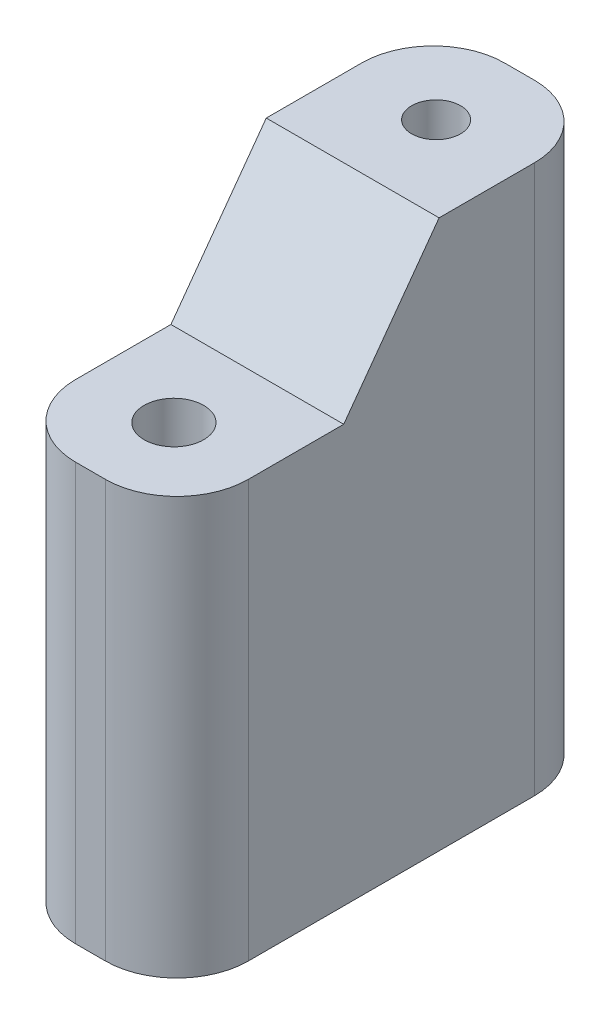
ISO-10303-21;
HEADER;
FILE_DESCRIPTION(('STEP AP214'),'2;1');
FILE_NAME('part.step','',(''),(''),'','','');
FILE_SCHEMA(('AUTOMOTIVE_DESIGN { 1 0 10303 214 1 1 1 1 }'));
ENDSEC;
DATA;
#1=APPLICATION_CONTEXT('core data for automotive mechanical design processes');
#2=APPLICATION_PROTOCOL_DEFINITION('international standard','automotive_design',2000,#1);
#3=PRODUCT_CONTEXT('',#1,'mechanical');
#4=PRODUCT('Part','Part','',(#3));
#5=PRODUCT_RELATED_PRODUCT_CATEGORY('part','',(#4));
#6=PRODUCT_DEFINITION_FORMATION('','',#4);
#7=PRODUCT_DEFINITION_CONTEXT('part definition',#1,'design');
#8=PRODUCT_DEFINITION('design','',#6,#7);
#9=PRODUCT_DEFINITION_SHAPE('','',#8);
#10=(LENGTH_UNIT() NAMED_UNIT(*) SI_UNIT(.MILLI.,.METRE.));
#11=(NAMED_UNIT(*) PLANE_ANGLE_UNIT() SI_UNIT($,.RADIAN.));
#12=(NAMED_UNIT(*) SI_UNIT($,.STERADIAN.) SOLID_ANGLE_UNIT());
#13=UNCERTAINTY_MEASURE_WITH_UNIT(LENGTH_MEASURE(1.E-05),#10,'distance_accuracy_value','');
#14=(GEOMETRIC_REPRESENTATION_CONTEXT(3) GLOBAL_UNCERTAINTY_ASSIGNED_CONTEXT((#13)) GLOBAL_UNIT_ASSIGNED_CONTEXT((#10,
#11,#12)) REPRESENTATION_CONTEXT('',''));
#15=CARTESIAN_POINT('',(0.,0.,0.));
#16=DIRECTION('',(0.,0.,1.));
#17=DIRECTION('',(1.,0.,0.));
#18=AXIS2_PLACEMENT_3D('',#15,#16,#17);
#19=CARTESIAN_POINT('',(3.625,23.,9.00000000000001));
#20=DIRECTION('',(-1.,0.,0.));
#21=DIRECTION('',(0.,0.,1.));
#22=AXIS2_PLACEMENT_3D('',#19,#20,#21);
#23=PLANE('',#22);
#24=DIRECTION('',(0.,0.,1.));
#25=VECTOR('',#24,1.);
#26=CARTESIAN_POINT('',(3.625,17.5,9.00000000000001));
#27=LINE('',#26,#25);
#28=CARTESIAN_POINT('',(3.625,17.5,2.00000000000001));
#29=VERTEX_POINT('',#28);
#30=CARTESIAN_POINT('',(3.625,17.5,6.00000000000001));
#31=VERTEX_POINT('',#30);
#32=EDGE_CURVE('E167',#29,#31,#27,.T.);
#33=ORIENTED_EDGE('',*,*,#32,.T.);
#34=DIRECTION('',(0.,-1.,0.));
#35=VECTOR('',#34,1.);
#36=CARTESIAN_POINT('',(3.625,23.,6.00000000000001));
#37=LINE('',#36,#35);
#38=CARTESIAN_POINT('',(3.625,0.,6.00000000000001));
#39=VERTEX_POINT('',#38);
#40=EDGE_CURVE('E190',#31,#39,#37,.T.);
#41=ORIENTED_EDGE('',*,*,#40,.T.);
#42=DIRECTION('',(0.,0.,-1.));
#43=VECTOR('',#42,1.);
#44=CARTESIAN_POINT('',(3.625,0.,9.00000000000001));
#45=LINE('',#44,#43);
#46=CARTESIAN_POINT('',(3.625,0.,-5.99999999999999));
#47=VERTEX_POINT('',#46);
#48=EDGE_CURVE('E170',#39,#47,#45,.T.);
#49=ORIENTED_EDGE('',*,*,#48,.T.);
#50=DIRECTION('',(0.,-1.,0.));
#51=VECTOR('',#50,1.);
#52=CARTESIAN_POINT('',(3.625,23.,-5.99999999999999));
#53=LINE('',#52,#51);
#54=CARTESIAN_POINT('',(3.625,23.,-5.99999999999999));
#55=VERTEX_POINT('',#54);
#56=EDGE_CURVE('E188',#47,#55,#53,.F.);
#57=ORIENTED_EDGE('',*,*,#56,.T.);
#58=DIRECTION('',(0.,0.,-1.));
#59=VECTOR('',#58,1.);
#60=CARTESIAN_POINT('',(3.625,23.,9.00000000000001));
#61=LINE('',#60,#59);
#62=CARTESIAN_POINT('',(3.625,23.,-1.99999999999999));
#63=VERTEX_POINT('',#62);
#64=EDGE_CURVE('E171',#63,#55,#61,.T.);
#65=ORIENTED_EDGE('',*,*,#64,.F.);
#66=DIRECTION('',(0.,-0.808736084303188,0.588171697675047));
#67=VECTOR('',#66,1.);
#68=CARTESIAN_POINT('',(3.625,17.7675675675676,1.80540540540541));
#69=LINE('',#68,#67);
#70=EDGE_CURVE('E162',#63,#29,#69,.T.);
#71=ORIENTED_EDGE('',*,*,#70,.T.);
#72=EDGE_LOOP('',(#33,#41,#49,#57,#65,#71));
#73=FACE_BOUND('',#72,.T.);
#74=ADVANCED_FACE('F38',(#73),#23,.F.);
#75=CARTESIAN_POINT('',(-3.625,23.,-8.99999999999999));
#76=DIRECTION('',(0.,0.,1.));
#77=DIRECTION('',(1.,0.,0.));
#78=AXIS2_PLACEMENT_3D('',#75,#76,#77);
#79=PLANE('',#78);
#80=DIRECTION('',(-1.,0.,0.));
#81=VECTOR('',#80,1.);
#82=CARTESIAN_POINT('',(-3.625,23.,-8.99999999999999));
#83=LINE('',#82,#81);
#84=CARTESIAN_POINT('',(0.625000000000003,23.,-8.99999999999999));
#85=VERTEX_POINT('',#84);
#86=CARTESIAN_POINT('',(-0.624999999999997,23.,-8.99999999999999));
#87=VERTEX_POINT('',#86);
#88=EDGE_CURVE('E173',#85,#87,#83,.T.);
#89=ORIENTED_EDGE('',*,*,#88,.F.);
#90=DIRECTION('',(0.,-1.,0.));
#91=VECTOR('',#90,1.);
#92=CARTESIAN_POINT('',(0.625000000000004,23.,-8.99999999999999));
#93=LINE('',#92,#91);
#94=CARTESIAN_POINT('',(0.625000000000003,0.,-8.99999999999999));
#95=VERTEX_POINT('',#94);
#96=EDGE_CURVE('E216',#85,#95,#93,.T.);
#97=ORIENTED_EDGE('',*,*,#96,.T.);
#98=DIRECTION('',(-1.,0.,0.));
#99=VECTOR('',#98,1.);
#100=CARTESIAN_POINT('',(-3.625,0.,-8.99999999999999));
#101=LINE('',#100,#99);
#102=CARTESIAN_POINT('',(-0.624999999999997,0.,-8.99999999999999));
#103=VERTEX_POINT('',#102);
#104=EDGE_CURVE('E179',#95,#103,#101,.T.);
#105=ORIENTED_EDGE('',*,*,#104,.T.);
#106=DIRECTION('',(0.,-1.,0.));
#107=VECTOR('',#106,1.);
#108=CARTESIAN_POINT('',(-0.624999999999996,23.,-8.99999999999999));
#109=LINE('',#108,#107);
#110=EDGE_CURVE('E53',#103,#87,#109,.F.);
#111=ORIENTED_EDGE('',*,*,#110,.T.);
#112=EDGE_LOOP('',(#89,#97,#105,#111));
#113=FACE_BOUND('',#112,.T.);
#114=ADVANCED_FACE('F232',(#113),#79,.F.);
#115=CARTESIAN_POINT('',(-3.625,23.,9.00000000000001));
#116=DIRECTION('',(1.,0.,0.));
#117=DIRECTION('',(0.,0.,-1.));
#118=AXIS2_PLACEMENT_3D('',#115,#116,#117);
#119=PLANE('',#118);
#120=DIRECTION('',(0.,0.,1.));
#121=VECTOR('',#120,1.);
#122=CARTESIAN_POINT('',(-3.625,0.,9.00000000000001));
#123=LINE('',#122,#121);
#124=CARTESIAN_POINT('',(-3.625,0.,-5.99999999999999));
#125=VERTEX_POINT('',#124);
#126=CARTESIAN_POINT('',(-3.625,0.,6.00000000000001));
#127=VERTEX_POINT('',#126);
#128=EDGE_CURVE('E181',#125,#127,#123,.T.);
#129=ORIENTED_EDGE('',*,*,#128,.T.);
#130=DIRECTION('',(0.,-1.,0.));
#131=VECTOR('',#130,1.);
#132=CARTESIAN_POINT('',(-3.625,23.,6.00000000000001));
#133=LINE('',#132,#131);
#134=CARTESIAN_POINT('',(-3.625,17.5,6.00000000000001));
#135=VERTEX_POINT('',#134);
#136=EDGE_CURVE('E213',#127,#135,#133,.F.);
#137=ORIENTED_EDGE('',*,*,#136,.T.);
#138=DIRECTION('',(0.,0.,-1.));
#139=VECTOR('',#138,1.);
#140=CARTESIAN_POINT('',(-3.625,17.5,9.00000000000001));
#141=LINE('',#140,#139);
#142=CARTESIAN_POINT('',(-3.625,17.5,2.00000000000001));
#143=VERTEX_POINT('',#142);
#144=EDGE_CURVE('E165',#135,#143,#141,.T.);
#145=ORIENTED_EDGE('',*,*,#144,.T.);
#146=DIRECTION('',(0.,0.808736084303188,-0.588171697675047));
#147=VECTOR('',#146,1.);
#148=CARTESIAN_POINT('',(-3.625,17.7675675675676,1.80540540540541));
#149=LINE('',#148,#147);
#150=CARTESIAN_POINT('',(-3.625,23.,-1.99999999999999));
#151=VERTEX_POINT('',#150);
#152=EDGE_CURVE('E159',#143,#151,#149,.T.);
#153=ORIENTED_EDGE('',*,*,#152,.T.);
#154=DIRECTION('',(0.,0.,1.));
#155=VECTOR('',#154,1.);
#156=CARTESIAN_POINT('',(-3.625,23.,9.00000000000001));
#157=LINE('',#156,#155);
#158=CARTESIAN_POINT('',(-3.625,23.,-5.99999999999999));
#159=VERTEX_POINT('',#158);
#160=EDGE_CURVE('E156',#159,#151,#157,.T.);
#161=ORIENTED_EDGE('',*,*,#160,.F.);
#162=DIRECTION('',(0.,-1.,0.));
#163=VECTOR('',#162,1.);
#164=CARTESIAN_POINT('',(-3.625,23.,-5.99999999999999));
#165=LINE('',#164,#163);
#166=EDGE_CURVE('E210',#159,#125,#165,.T.);
#167=ORIENTED_EDGE('',*,*,#166,.T.);
#168=EDGE_LOOP('',(#129,#137,#145,#153,#161,#167));
#169=FACE_BOUND('',#168,.T.);
#170=ADVANCED_FACE('F225',(#169),#119,.F.);
#171=CARTESIAN_POINT('',(-3.625,23.,9.00000000000001));
#172=DIRECTION('',(0.,0.,-1.));
#173=DIRECTION('',(-1.,0.,0.));
#174=AXIS2_PLACEMENT_3D('',#171,#172,#173);
#175=PLANE('',#174);
#176=DIRECTION('',(1.,0.,0.));
#177=VECTOR('',#176,1.);
#178=CARTESIAN_POINT('',(-3.625,0.,9.00000000000001));
#179=LINE('',#178,#177);
#180=CARTESIAN_POINT('',(-0.624999999999997,0.,9.00000000000001));
#181=VERTEX_POINT('',#180);
#182=CARTESIAN_POINT('',(0.625000000000003,0.,9.00000000000001));
#183=VERTEX_POINT('',#182);
#184=EDGE_CURVE('E174',#181,#183,#179,.T.);
#185=ORIENTED_EDGE('',*,*,#184,.T.);
#186=DIRECTION('',(0.,-1.,0.));
#187=VECTOR('',#186,1.);
#188=CARTESIAN_POINT('',(0.625000000000004,23.,9.00000000000001));
#189=LINE('',#188,#187);
#190=CARTESIAN_POINT('',(0.625000000000004,17.5,9.00000000000001));
#191=VERTEX_POINT('',#190);
#192=EDGE_CURVE('E204',#183,#191,#189,.F.);
#193=ORIENTED_EDGE('',*,*,#192,.T.);
#194=DIRECTION('',(-1.,0.,0.));
#195=VECTOR('',#194,1.);
#196=CARTESIAN_POINT('',(-3.625,17.5,9.00000000000001));
#197=LINE('',#196,#195);
#198=CARTESIAN_POINT('',(-0.624999999999996,17.5,9.00000000000001));
#199=VERTEX_POINT('',#198);
#200=EDGE_CURVE('E155',#191,#199,#197,.T.);
#201=ORIENTED_EDGE('',*,*,#200,.T.);
#202=DIRECTION('',(0.,-1.,0.));
#203=VECTOR('',#202,1.);
#204=CARTESIAN_POINT('',(-0.624999999999996,23.,9.00000000000001));
#205=LINE('',#204,#203);
#206=EDGE_CURVE('E201',#199,#181,#205,.T.);
#207=ORIENTED_EDGE('',*,*,#206,.T.);
#208=EDGE_LOOP('',(#185,#193,#201,#207));
#209=FACE_BOUND('',#208,.T.);
#210=ADVANCED_FACE('F246',(#209),#175,.F.);
#211=CARTESIAN_POINT('',(0.,23.,0.));
#212=DIRECTION('',(0.,-1.,0.));
#213=DIRECTION('',(0.,0.,-1.));
#214=AXIS2_PLACEMENT_3D('',#211,#212,#213);
#215=PLANE('',#214);
#216=CARTESIAN_POINT('',(0.,23.,-5.5));
#217=DIRECTION('',(0.,1.,0.));
#218=DIRECTION('',(0.,0.,1.));
#219=AXIS2_PLACEMENT_3D('',#216,#217,#218);
#220=CIRCLE('',#219,1.02499999999999);
#221=CARTESIAN_POINT('',(0.,23.,-4.47500000000001));
#222=VERTEX_POINT('',#221);
#223=EDGE_CURVE('E132',#222,#222,#220,.T.);
#224=ORIENTED_EDGE('',*,*,#223,.F.);
#225=EDGE_LOOP('',(#224));
#226=FACE_BOUND('',#225,.T.);
#227=ORIENTED_EDGE('',*,*,#64,.T.);
#228=CARTESIAN_POINT('',(0.625000000000004,23.,-5.99999999999999));
#229=DIRECTION('',(0.,-1.,0.));
#230=DIRECTION('',(0.,0.,-1.));
#231=AXIS2_PLACEMENT_3D('',#228,#229,#230);
#232=CIRCLE('',#231,3.);
#233=EDGE_CURVE('E11',#55,#85,#232,.F.);
#234=ORIENTED_EDGE('',*,*,#233,.T.);
#235=ORIENTED_EDGE('',*,*,#88,.T.);
#236=CARTESIAN_POINT('',(-0.624999999999996,23.,-5.99999999999999));
#237=DIRECTION('',(0.,-1.,0.));
#238=DIRECTION('',(0.,0.,-1.));
#239=AXIS2_PLACEMENT_3D('',#236,#237,#238);
#240=CIRCLE('',#239,3.);
#241=EDGE_CURVE('E46',#87,#159,#240,.F.);
#242=ORIENTED_EDGE('',*,*,#241,.T.);
#243=ORIENTED_EDGE('',*,*,#160,.T.);
#244=DIRECTION('',(1.,0.,0.));
#245=VECTOR('',#244,1.);
#246=CARTESIAN_POINT('',(-50.3032069088167,23.,-1.99999999999999));
#247=LINE('',#246,#245);
#248=EDGE_CURVE('E152',#151,#63,#247,.T.);
#249=ORIENTED_EDGE('',*,*,#248,.T.);
#250=EDGE_LOOP('',(#227,#234,#235,#242,#243,#249));
#251=FACE_BOUND('',#250,.T.);
#252=ADVANCED_FACE('F220',(#226,#251),#215,.F.);
#253=CARTESIAN_POINT('',(0.,0.,0.));
#254=DIRECTION('',(0.,-1.,0.));
#255=DIRECTION('',(0.,0.,-1.));
#256=AXIS2_PLACEMENT_3D('',#253,#254,#255);
#257=PLANE('',#256);
#258=CARTESIAN_POINT('',(0.,0.,0.));
#259=DIRECTION('',(0.,-1.,0.));
#260=DIRECTION('',(0.,0.,-1.));
#261=AXIS2_PLACEMENT_3D('',#258,#259,#260);
#262=CIRCLE('',#261,1.02499999999999);
#263=CARTESIAN_POINT('',(0.,0.,-1.02499999999999));
#264=VERTEX_POINT('',#263);
#265=EDGE_CURVE('E145',#264,#264,#262,.T.);
#266=ORIENTED_EDGE('',*,*,#265,.F.);
#267=EDGE_LOOP('',(#266));
#268=FACE_BOUND('',#267,.T.);
#269=ORIENTED_EDGE('',*,*,#48,.F.);
#270=CARTESIAN_POINT('',(0.625000000000004,0.,6.00000000000001));
#271=DIRECTION('',(0.,-1.,0.));
#272=DIRECTION('',(0.,0.,-1.));
#273=AXIS2_PLACEMENT_3D('',#270,#271,#272);
#274=CIRCLE('',#273,3.);
#275=EDGE_CURVE('E199',#39,#183,#274,.T.);
#276=ORIENTED_EDGE('',*,*,#275,.T.);
#277=ORIENTED_EDGE('',*,*,#184,.F.);
#278=CARTESIAN_POINT('',(-0.624999999999996,0.,6.00000000000001));
#279=DIRECTION('',(0.,-1.,0.));
#280=DIRECTION('',(0.,0.,-1.));
#281=AXIS2_PLACEMENT_3D('',#278,#279,#280);
#282=CIRCLE('',#281,3.);
#283=EDGE_CURVE('E197',#181,#127,#282,.T.);
#284=ORIENTED_EDGE('',*,*,#283,.T.);
#285=ORIENTED_EDGE('',*,*,#128,.F.);
#286=CARTESIAN_POINT('',(-0.624999999999996,0.,-5.99999999999999));
#287=DIRECTION('',(0.,-1.,0.));
#288=DIRECTION('',(0.,0.,-1.));
#289=AXIS2_PLACEMENT_3D('',#286,#287,#288);
#290=CIRCLE('',#289,3.);
#291=EDGE_CURVE('E193',#125,#103,#290,.T.);
#292=ORIENTED_EDGE('',*,*,#291,.T.);
#293=ORIENTED_EDGE('',*,*,#104,.F.);
#294=CARTESIAN_POINT('',(0.625000000000004,0.,-5.99999999999999));
#295=DIRECTION('',(0.,-1.,0.));
#296=DIRECTION('',(0.,0.,-1.));
#297=AXIS2_PLACEMENT_3D('',#294,#295,#296);
#298=CIRCLE('',#297,3.);
#299=EDGE_CURVE('E195',#95,#47,#298,.T.);
#300=ORIENTED_EDGE('',*,*,#299,.T.);
#301=EDGE_LOOP('',(#269,#276,#277,#284,#285,#292,#293,#300));
#302=FACE_BOUND('',#301,.T.);
#303=ADVANCED_FACE('F231',(#268,#302),#257,.T.);
#304=CARTESIAN_POINT('',(-50.3032069088167,17.5,2.00000000000001));
#305=DIRECTION('',(0.,-1.,0.));
#306=DIRECTION('',(0.,0.,-1.));
#307=AXIS2_PLACEMENT_3D('',#304,#305,#306);
#308=PLANE('',#307);
#309=CARTESIAN_POINT('',(0.,17.5000000000001,5.50000000000001));
#310=DIRECTION('',(0.,1.,0.));
#311=DIRECTION('',(0.,0.,1.));
#312=AXIS2_PLACEMENT_3D('',#309,#310,#311);
#313=CIRCLE('',#312,1.24999999999997);
#314=CARTESIAN_POINT('',(0.,17.5000000000001,6.74999999999998));
#315=VERTEX_POINT('',#314);
#316=EDGE_CURVE('E450',#315,#315,#313,.T.);
#317=ORIENTED_EDGE('',*,*,#316,.F.);
#318=EDGE_LOOP('',(#317));
#319=FACE_BOUND('',#318,.T.);
#320=ORIENTED_EDGE('',*,*,#200,.F.);
#321=CARTESIAN_POINT('',(0.625000000000004,17.5,6.00000000000001));
#322=DIRECTION('',(0.,-1.,0.));
#323=DIRECTION('',(0.,0.,-1.));
#324=AXIS2_PLACEMENT_3D('',#321,#322,#323);
#325=CIRCLE('',#324,3.);
#326=EDGE_CURVE('E208',#191,#31,#325,.F.);
#327=ORIENTED_EDGE('',*,*,#326,.T.);
#328=ORIENTED_EDGE('',*,*,#32,.F.);
#329=DIRECTION('',(1.,0.,0.));
#330=VECTOR('',#329,1.);
#331=CARTESIAN_POINT('',(-50.3032069088167,17.5,2.00000000000001));
#332=LINE('',#331,#330);
#333=EDGE_CURVE('E151',#143,#29,#332,.T.);
#334=ORIENTED_EDGE('',*,*,#333,.F.);
#335=ORIENTED_EDGE('',*,*,#144,.F.);
#336=CARTESIAN_POINT('',(-0.624999999999996,17.5,6.00000000000001));
#337=DIRECTION('',(0.,-1.,0.));
#338=DIRECTION('',(0.,0.,-1.));
#339=AXIS2_PLACEMENT_3D('',#336,#337,#338);
#340=CIRCLE('',#339,3.);
#341=EDGE_CURVE('E206',#135,#199,#340,.F.);
#342=ORIENTED_EDGE('',*,*,#341,.T.);
#343=EDGE_LOOP('',(#320,#327,#328,#334,#335,#342));
#344=FACE_BOUND('',#343,.T.);
#345=ADVANCED_FACE('F256',(#319,#344),#308,.F.);
#346=CARTESIAN_POINT('',(-50.3032069088167,23.,-1.99999999999999));
#347=DIRECTION('',(0.,-0.588171697675047,-0.808736084303188));
#348=DIRECTION('',(0.,0.808736084303188,-0.588171697675047));
#349=AXIS2_PLACEMENT_3D('',#346,#347,#348);
#350=PLANE('',#349);
#351=ORIENTED_EDGE('',*,*,#70,.F.);
#352=ORIENTED_EDGE('',*,*,#248,.F.);
#353=ORIENTED_EDGE('',*,*,#152,.F.);
#354=ORIENTED_EDGE('',*,*,#333,.T.);
#355=EDGE_LOOP('',(#351,#352,#353,#354));
#356=FACE_BOUND('',#355,.T.);
#357=ADVANCED_FACE('F258',(#356),#350,.F.);
#358=CARTESIAN_POINT('',(0.,6.34999999999999,0.));
#359=DIRECTION('',(0.,-1.,0.));
#360=DIRECTION('',(0.,0.,-1.));
#361=AXIS2_PLACEMENT_3D('',#358,#359,#360);
#362=CONICAL_SURFACE('',#361,1.02499999999999,1.02974425867665);
#363=CARTESIAN_POINT('',(0.,6.96588213450325,0.));
#364=VERTEX_POINT('',#363);
#365=VERTEX_LOOP('',#364);
#366=FACE_BOUND('',#365,.T.);
#367=CARTESIAN_POINT('',(0.,6.34999999999999,0.));
#368=DIRECTION('',(0.,-1.,0.));
#369=DIRECTION('',(0.,0.,-1.));
#370=AXIS2_PLACEMENT_3D('',#367,#368,#369);
#371=CIRCLE('',#370,1.02499999999999);
#372=CARTESIAN_POINT('',(0.,6.34999999999999,-1.02499999999999));
#373=VERTEX_POINT('',#372);
#374=EDGE_CURVE('E148',#373,#373,#371,.T.);
#375=ORIENTED_EDGE('',*,*,#374,.T.);
#376=EDGE_LOOP('',(#375));
#377=FACE_BOUND('',#376,.T.);
#378=ADVANCED_FACE('F260',(#366,#377),#362,.F.);
#379=CARTESIAN_POINT('',(0.,0.,0.));
#380=DIRECTION('',(0.,-1.,0.));
#381=DIRECTION('',(0.,0.,-1.));
#382=AXIS2_PLACEMENT_3D('',#379,#380,#381);
#383=CYLINDRICAL_SURFACE('',#382,1.02499999999999);
#384=ORIENTED_EDGE('',*,*,#374,.F.);
#385=EDGE_LOOP('',(#384));
#386=FACE_BOUND('',#385,.T.);
#387=ORIENTED_EDGE('',*,*,#265,.T.);
#388=EDGE_LOOP('',(#387));
#389=FACE_BOUND('',#388,.T.);
#390=ADVANCED_FACE('F266',(#386,#389),#383,.F.);
#391=CARTESIAN_POINT('',(0.,16.65,-5.5));
#392=DIRECTION('',(0.,1.,0.));
#393=DIRECTION('',(0.,0.,1.));
#394=AXIS2_PLACEMENT_3D('',#391,#392,#393);
#395=CONICAL_SURFACE('',#394,1.02499999999999,1.02974425867665);
#396=CARTESIAN_POINT('',(0.,16.0341178654967,-5.5));
#397=VERTEX_POINT('',#396);
#398=VERTEX_LOOP('',#397);
#399=FACE_BOUND('',#398,.T.);
#400=CARTESIAN_POINT('',(0.,16.65,-5.5));
#401=DIRECTION('',(0.,1.,0.));
#402=DIRECTION('',(0.,0.,1.));
#403=AXIS2_PLACEMENT_3D('',#400,#401,#402);
#404=CIRCLE('',#403,1.02499999999999);
#405=CARTESIAN_POINT('',(0.,16.65,-4.47500000000001));
#406=VERTEX_POINT('',#405);
#407=EDGE_CURVE('E136',#406,#406,#404,.T.);
#408=ORIENTED_EDGE('',*,*,#407,.T.);
#409=EDGE_LOOP('',(#408));
#410=FACE_BOUND('',#409,.T.);
#411=ADVANCED_FACE('F398',(#399,#410),#395,.F.);
#412=CARTESIAN_POINT('',(0.,23.,-5.5));
#413=DIRECTION('',(0.,1.,0.));
#414=DIRECTION('',(0.,0.,1.));
#415=AXIS2_PLACEMENT_3D('',#412,#413,#414);
#416=CYLINDRICAL_SURFACE('',#415,1.02499999999999);
#417=ORIENTED_EDGE('',*,*,#407,.F.);
#418=EDGE_LOOP('',(#417));
#419=FACE_BOUND('',#418,.T.);
#420=ORIENTED_EDGE('',*,*,#223,.T.);
#421=EDGE_LOOP('',(#420));
#422=FACE_BOUND('',#421,.T.);
#423=ADVANCED_FACE('F126',(#419,#422),#416,.F.);
#424=CARTESIAN_POINT('',(0.,11.15,5.50000000000001));
#425=DIRECTION('',(0.,1.,0.));
#426=DIRECTION('',(0.,0.,1.));
#427=AXIS2_PLACEMENT_3D('',#424,#425,#426);
#428=CONICAL_SURFACE('',#427,1.025,1.02974425867665);
#429=CARTESIAN_POINT('',(0.,10.5341178654968,5.50000000000001));
#430=VERTEX_POINT('',#429);
#431=VERTEX_LOOP('',#430);
#432=FACE_BOUND('',#431,.T.);
#433=CARTESIAN_POINT('',(0.,11.15,5.50000000000001));
#434=DIRECTION('',(0.,1.,0.));
#435=DIRECTION('',(0.,0.,1.));
#436=AXIS2_PLACEMENT_3D('',#433,#434,#435);
#437=CIRCLE('',#436,1.025);
#438=CARTESIAN_POINT('',(0.,11.15,6.52500000000001));
#439=VERTEX_POINT('',#438);
#440=EDGE_CURVE('E130',#439,#439,#437,.T.);
#441=ORIENTED_EDGE('',*,*,#440,.T.);
#442=EDGE_LOOP('',(#441));
#443=FACE_BOUND('',#442,.T.);
#444=ADVANCED_FACE('F122',(#432,#443),#428,.F.);
#445=CARTESIAN_POINT('',(0.,17.5,5.50000000000001));
#446=DIRECTION('',(0.,1.,0.));
#447=DIRECTION('',(0.,0.,1.));
#448=AXIS2_PLACEMENT_3D('',#445,#446,#447);
#449=CYLINDRICAL_SURFACE('',#448,1.025);
#450=ORIENTED_EDGE('',*,*,#440,.F.);
#451=EDGE_LOOP('',(#450));
#452=FACE_BOUND('',#451,.T.);
#453=CARTESIAN_POINT('',(0.,12.5,5.50000000000001));
#454=DIRECTION('',(0.,1.,0.));
#455=DIRECTION('',(0.,0.,1.));
#456=AXIS2_PLACEMENT_3D('',#453,#454,#455);
#457=CIRCLE('',#456,1.025);
#458=CARTESIAN_POINT('',(0.,12.5,6.52500000000001));
#459=VERTEX_POINT('',#458);
#460=EDGE_CURVE('E133',#459,#459,#457,.T.);
#461=ORIENTED_EDGE('',*,*,#460,.T.);
#462=EDGE_LOOP('',(#461));
#463=FACE_BOUND('',#462,.T.);
#464=ADVANCED_FACE('F125',(#452,#463),#449,.F.);
#465=CARTESIAN_POINT('',(1.025,12.5,5.50000000000001));
#466=DIRECTION('',(0.,-1.,0.));
#467=DIRECTION('',(0.,0.,-1.));
#468=AXIS2_PLACEMENT_3D('',#465,#466,#467);
#469=PLANE('',#468);
#470=ORIENTED_EDGE('',*,*,#460,.F.);
#471=EDGE_LOOP('',(#470));
#472=FACE_BOUND('',#471,.T.);
#473=CARTESIAN_POINT('',(0.,12.5,5.50000000000001));
#474=DIRECTION('',(0.,1.,0.));
#475=DIRECTION('',(0.,0.,1.));
#476=AXIS2_PLACEMENT_3D('',#473,#474,#475);
#477=CIRCLE('',#476,1.25);
#478=CARTESIAN_POINT('',(0.,12.5,6.75));
#479=VERTEX_POINT('',#478);
#480=EDGE_CURVE('E139',#479,#479,#477,.T.);
#481=ORIENTED_EDGE('',*,*,#480,.T.);
#482=EDGE_LOOP('',(#481));
#483=FACE_BOUND('',#482,.T.);
#484=ADVANCED_FACE('F364',(#472,#483),#469,.F.);
#485=CARTESIAN_POINT('',(0.,17.5,5.50000000000001));
#486=DIRECTION('',(0.,1.,0.));
#487=DIRECTION('',(0.,0.,1.));
#488=AXIS2_PLACEMENT_3D('',#485,#486,#487);
#489=CYLINDRICAL_SURFACE('',#488,1.24999999999998);
#490=ORIENTED_EDGE('',*,*,#480,.F.);
#491=EDGE_LOOP('',(#490));
#492=FACE_BOUND('',#491,.T.);
#493=ORIENTED_EDGE('',*,*,#316,.T.);
#494=EDGE_LOOP('',(#493));
#495=FACE_BOUND('',#494,.T.);
#496=ADVANCED_FACE('F281',(#492,#495),#489,.F.);
#497=CARTESIAN_POINT('',(0.625000000000004,23.,6.00000000000001));
#498=DIRECTION('',(0.,-1.,0.));
#499=DIRECTION('',(0.,0.,-1.));
#500=AXIS2_PLACEMENT_3D('',#497,#498,#499);
#501=CYLINDRICAL_SURFACE('',#500,3.);
#502=ORIENTED_EDGE('',*,*,#326,.F.);
#503=ORIENTED_EDGE('',*,*,#192,.F.);
#504=ORIENTED_EDGE('',*,*,#275,.F.);
#505=ORIENTED_EDGE('',*,*,#40,.F.);
#506=EDGE_LOOP('',(#502,#503,#504,#505));
#507=FACE_BOUND('',#506,.T.);
#508=ADVANCED_FACE('F242',(#507),#501,.T.);
#509=CARTESIAN_POINT('',(-0.624999999999996,23.,6.00000000000001));
#510=DIRECTION('',(0.,-1.,0.));
#511=DIRECTION('',(0.,0.,-1.));
#512=AXIS2_PLACEMENT_3D('',#509,#510,#511);
#513=CYLINDRICAL_SURFACE('',#512,3.);
#514=ORIENTED_EDGE('',*,*,#341,.F.);
#515=ORIENTED_EDGE('',*,*,#136,.F.);
#516=ORIENTED_EDGE('',*,*,#283,.F.);
#517=ORIENTED_EDGE('',*,*,#206,.F.);
#518=EDGE_LOOP('',(#514,#515,#516,#517));
#519=FACE_BOUND('',#518,.T.);
#520=ADVANCED_FACE('F251',(#519),#513,.T.);
#521=CARTESIAN_POINT('',(0.625000000000004,23.,-5.99999999999999));
#522=DIRECTION('',(0.,-1.,0.));
#523=DIRECTION('',(0.,0.,-1.));
#524=AXIS2_PLACEMENT_3D('',#521,#522,#523);
#525=CYLINDRICAL_SURFACE('',#524,3.);
#526=ORIENTED_EDGE('',*,*,#233,.F.);
#527=ORIENTED_EDGE('',*,*,#56,.F.);
#528=ORIENTED_EDGE('',*,*,#299,.F.);
#529=ORIENTED_EDGE('',*,*,#96,.F.);
#530=EDGE_LOOP('',(#526,#527,#528,#529));
#531=FACE_BOUND('',#530,.T.);
#532=ADVANCED_FACE('F235',(#531),#525,.T.);
#533=CARTESIAN_POINT('',(-0.624999999999996,23.,-5.99999999999999));
#534=DIRECTION('',(0.,-1.,0.));
#535=DIRECTION('',(0.,0.,-1.));
#536=AXIS2_PLACEMENT_3D('',#533,#534,#535);
#537=CYLINDRICAL_SURFACE('',#536,3.);
#538=ORIENTED_EDGE('',*,*,#241,.F.);
#539=ORIENTED_EDGE('',*,*,#110,.F.);
#540=ORIENTED_EDGE('',*,*,#291,.F.);
#541=ORIENTED_EDGE('',*,*,#166,.F.);
#542=EDGE_LOOP('',(#538,#539,#540,#541));
#543=FACE_BOUND('',#542,.T.);
#544=ADVANCED_FACE('F40',(#543),#537,.T.);
#545=CLOSED_SHELL('',(#74,#114,#170,#210,#252,#303,#345,#357,#378,#390,#411,#423,#444,#464,#484,
#496,#508,#520,#532,#544));
#546=MANIFOLD_SOLID_BREP('B2',#545);
#547=ADVANCED_BREP_SHAPE_REPRESENTATION('',(#18,#546),#14);
#548=SHAPE_DEFINITION_REPRESENTATION(#9,#547);
ENDSEC;
END-ISO-10303-21;
